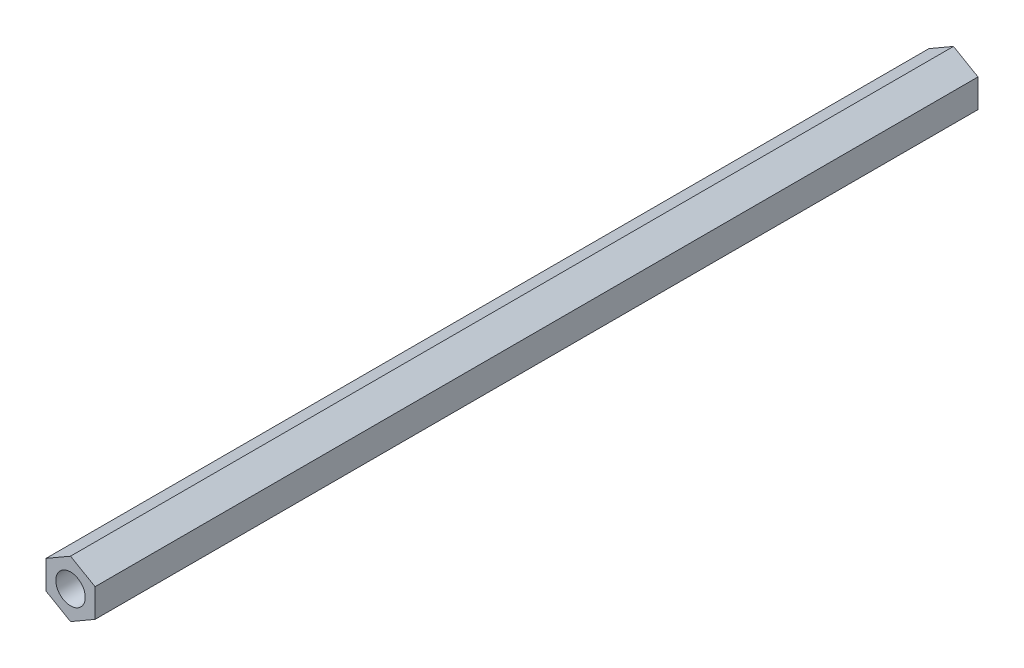
ISO-10303-21;
HEADER;
FILE_DESCRIPTION(('STEP AP214'),'2;1');
FILE_NAME('part.step','',(''),(''),'','','');
FILE_SCHEMA(('AUTOMOTIVE_DESIGN { 1 0 10303 214 1 1 1 1 }'));
ENDSEC;
DATA;
#1=APPLICATION_CONTEXT('core data for automotive mechanical design processes');
#2=APPLICATION_PROTOCOL_DEFINITION('international standard','automotive_design',2000,#1);
#3=PRODUCT_CONTEXT('',#1,'mechanical');
#4=PRODUCT('Part','Part','',(#3));
#5=PRODUCT_RELATED_PRODUCT_CATEGORY('part','',(#4));
#6=PRODUCT_DEFINITION_FORMATION('','',#4);
#7=PRODUCT_DEFINITION_CONTEXT('part definition',#1,'design');
#8=PRODUCT_DEFINITION('design','',#6,#7);
#9=PRODUCT_DEFINITION_SHAPE('','',#8);
#10=(LENGTH_UNIT() NAMED_UNIT(*) SI_UNIT(.MILLI.,.METRE.));
#11=(NAMED_UNIT(*) PLANE_ANGLE_UNIT() SI_UNIT($,.RADIAN.));
#12=(NAMED_UNIT(*) SI_UNIT($,.STERADIAN.) SOLID_ANGLE_UNIT());
#13=UNCERTAINTY_MEASURE_WITH_UNIT(LENGTH_MEASURE(1.E-05),#10,'distance_accuracy_value','');
#14=(GEOMETRIC_REPRESENTATION_CONTEXT(3) GLOBAL_UNCERTAINTY_ASSIGNED_CONTEXT((#13)) GLOBAL_UNIT_ASSIGNED_CONTEXT((#10,
#11,#12)) REPRESENTATION_CONTEXT('',''));
#15=CARTESIAN_POINT('',(0.,0.,0.));
#16=DIRECTION('',(0.,0.,1.));
#17=DIRECTION('',(1.,0.,0.));
#18=AXIS2_PLACEMENT_3D('',#15,#16,#17);
#19=CARTESIAN_POINT('',(0.,0.,90.));
#20=DIRECTION('',(0.,0.,1.));
#21=DIRECTION('',(1.,0.,0.));
#22=AXIS2_PLACEMENT_3D('',#19,#20,#21);
#23=PLANE('',#22);
#24=DIRECTION('',(-0.866025403784439,0.5,0.));
#25=VECTOR('',#24,1.);
#26=CARTESIAN_POINT('',(2.5,1.44337567297407,90.));
#27=LINE('',#26,#25);
#28=CARTESIAN_POINT('',(2.5,1.44337567297407,90.));
#29=VERTEX_POINT('',#28);
#30=CARTESIAN_POINT('',(0.,2.88675134594813,90.));
#31=VERTEX_POINT('',#30);
#32=EDGE_CURVE('E129',#29,#31,#27,.T.);
#33=ORIENTED_EDGE('',*,*,#32,.T.);
#34=DIRECTION('',(-0.866025403784439,-0.5,0.));
#35=VECTOR('',#34,1.);
#36=CARTESIAN_POINT('',(0.,2.88675134594813,90.));
#37=LINE('',#36,#35);
#38=CARTESIAN_POINT('',(-2.5,1.44337567297407,90.));
#39=VERTEX_POINT('',#38);
#40=EDGE_CURVE('E87',#31,#39,#37,.T.);
#41=ORIENTED_EDGE('',*,*,#40,.T.);
#42=DIRECTION('',(0.,-1.,0.));
#43=VECTOR('',#42,1.);
#44=CARTESIAN_POINT('',(-2.5,1.44337567297407,90.));
#45=LINE('',#44,#43);
#46=CARTESIAN_POINT('',(-2.5,-1.44337567297406,90.));
#47=VERTEX_POINT('',#46);
#48=EDGE_CURVE('E100',#39,#47,#45,.T.);
#49=ORIENTED_EDGE('',*,*,#48,.T.);
#50=DIRECTION('',(0.866025403784439,-0.5,0.));
#51=VECTOR('',#50,1.);
#52=CARTESIAN_POINT('',(-2.5,-1.44337567297406,90.));
#53=LINE('',#52,#51);
#54=CARTESIAN_POINT('',(0.,-2.88675134594813,90.));
#55=VERTEX_POINT('',#54);
#56=EDGE_CURVE('E94',#47,#55,#53,.T.);
#57=ORIENTED_EDGE('',*,*,#56,.T.);
#58=DIRECTION('',(0.866025403784439,0.5,0.));
#59=VECTOR('',#58,1.);
#60=CARTESIAN_POINT('',(0.,-2.88675134594813,90.));
#61=LINE('',#60,#59);
#62=CARTESIAN_POINT('',(2.5,-1.44337567297407,90.));
#63=VERTEX_POINT('',#62);
#64=EDGE_CURVE('E98',#55,#63,#61,.T.);
#65=ORIENTED_EDGE('',*,*,#64,.T.);
#66=DIRECTION('',(0.,1.,0.));
#67=VECTOR('',#66,1.);
#68=CARTESIAN_POINT('',(2.5,-1.44337567297407,90.));
#69=LINE('',#68,#67);
#70=EDGE_CURVE('E50',#63,#29,#69,.T.);
#71=ORIENTED_EDGE('',*,*,#70,.T.);
#72=EDGE_LOOP('',(#33,#41,#49,#57,#65,#71));
#73=FACE_BOUND('',#72,.T.);
#74=CARTESIAN_POINT('',(0.,0.,90.));
#75=DIRECTION('',(0.,0.,1.));
#76=DIRECTION('',(1.,0.,0.));
#77=AXIS2_PLACEMENT_3D('',#74,#75,#76);
#78=CIRCLE('',#77,1.5);
#79=CARTESIAN_POINT('',(1.5,0.,90.));
#80=VERTEX_POINT('',#79);
#81=EDGE_CURVE('E122',#80,#80,#78,.T.);
#82=ORIENTED_EDGE('',*,*,#81,.F.);
#83=EDGE_LOOP('',(#82));
#84=FACE_BOUND('',#83,.T.);
#85=ADVANCED_FACE('F33',(#73,#84),#23,.T.);
#86=CARTESIAN_POINT('',(0.,0.,0.));
#87=DIRECTION('',(0.,0.,1.));
#88=DIRECTION('',(1.,0.,0.));
#89=AXIS2_PLACEMENT_3D('',#86,#87,#88);
#90=PLANE('',#89);
#91=DIRECTION('',(-0.866025403784439,0.5,0.));
#92=VECTOR('',#91,1.);
#93=CARTESIAN_POINT('',(2.5,1.44337567297407,0.));
#94=LINE('',#93,#92);
#95=CARTESIAN_POINT('',(2.5,1.44337567297407,0.));
#96=VERTEX_POINT('',#95);
#97=CARTESIAN_POINT('',(0.,2.88675134594813,0.));
#98=VERTEX_POINT('',#97);
#99=EDGE_CURVE('E118',#96,#98,#94,.T.);
#100=ORIENTED_EDGE('',*,*,#99,.F.);
#101=DIRECTION('',(0.,1.,0.));
#102=VECTOR('',#101,1.);
#103=CARTESIAN_POINT('',(2.5,-1.44337567297407,0.));
#104=LINE('',#103,#102);
#105=CARTESIAN_POINT('',(2.5,-1.44337567297407,0.));
#106=VERTEX_POINT('',#105);
#107=EDGE_CURVE('E79',#106,#96,#104,.T.);
#108=ORIENTED_EDGE('',*,*,#107,.F.);
#109=DIRECTION('',(0.866025403784439,0.5,0.));
#110=VECTOR('',#109,1.);
#111=CARTESIAN_POINT('',(0.,-2.88675134594813,0.));
#112=LINE('',#111,#110);
#113=CARTESIAN_POINT('',(0.,-2.88675134594813,0.));
#114=VERTEX_POINT('',#113);
#115=EDGE_CURVE('E73',#114,#106,#112,.T.);
#116=ORIENTED_EDGE('',*,*,#115,.F.);
#117=DIRECTION('',(0.866025403784439,-0.5,0.));
#118=VECTOR('',#117,1.);
#119=CARTESIAN_POINT('',(-2.5,-1.44337567297406,0.));
#120=LINE('',#119,#118);
#121=CARTESIAN_POINT('',(-2.5,-1.44337567297406,0.));
#122=VERTEX_POINT('',#121);
#123=EDGE_CURVE('E108',#122,#114,#120,.T.);
#124=ORIENTED_EDGE('',*,*,#123,.F.);
#125=DIRECTION('',(0.,-1.,0.));
#126=VECTOR('',#125,1.);
#127=CARTESIAN_POINT('',(-2.5,1.44337567297407,0.));
#128=LINE('',#127,#126);
#129=CARTESIAN_POINT('',(-2.5,1.44337567297407,0.));
#130=VERTEX_POINT('',#129);
#131=EDGE_CURVE('E124',#130,#122,#128,.T.);
#132=ORIENTED_EDGE('',*,*,#131,.F.);
#133=DIRECTION('',(-0.866025403784439,-0.5,0.));
#134=VECTOR('',#133,1.);
#135=CARTESIAN_POINT('',(0.,2.88675134594813,0.));
#136=LINE('',#135,#134);
#137=EDGE_CURVE('E121',#98,#130,#136,.T.);
#138=ORIENTED_EDGE('',*,*,#137,.F.);
#139=EDGE_LOOP('',(#100,#108,#116,#124,#132,#138));
#140=FACE_BOUND('',#139,.T.);
#141=CARTESIAN_POINT('',(0.,0.,0.));
#142=DIRECTION('',(0.,0.,1.));
#143=DIRECTION('',(1.,0.,0.));
#144=AXIS2_PLACEMENT_3D('',#141,#142,#143);
#145=CIRCLE('',#144,1.5);
#146=CARTESIAN_POINT('',(1.5,0.,0.));
#147=VERTEX_POINT('',#146);
#148=EDGE_CURVE('E222',#147,#147,#145,.T.);
#149=ORIENTED_EDGE('',*,*,#148,.T.);
#150=EDGE_LOOP('',(#149));
#151=FACE_BOUND('',#150,.T.);
#152=ADVANCED_FACE('F138',(#140,#151),#90,.F.);
#153=CARTESIAN_POINT('',(2.5,1.44337567297407,90.));
#154=DIRECTION('',(-0.5,-0.866025403784439,0.));
#155=DIRECTION('',(0.866025403784439,-0.5,0.));
#156=AXIS2_PLACEMENT_3D('',#153,#154,#155);
#157=PLANE('',#156);
#158=ORIENTED_EDGE('',*,*,#99,.T.);
#159=DIRECTION('',(0.,0.,-1.));
#160=VECTOR('',#159,1.);
#161=CARTESIAN_POINT('',(0.,2.88675134594813,90.));
#162=LINE('',#161,#160);
#163=EDGE_CURVE('E11',#31,#98,#162,.T.);
#164=ORIENTED_EDGE('',*,*,#163,.F.);
#165=ORIENTED_EDGE('',*,*,#32,.F.);
#166=DIRECTION('',(0.,0.,-1.));
#167=VECTOR('',#166,1.);
#168=CARTESIAN_POINT('',(2.5,1.44337567297407,90.));
#169=LINE('',#168,#167);
#170=EDGE_CURVE('E114',#29,#96,#169,.T.);
#171=ORIENTED_EDGE('',*,*,#170,.T.);
#172=EDGE_LOOP('',(#158,#164,#165,#171));
#173=FACE_BOUND('',#172,.T.);
#174=ADVANCED_FACE('F35',(#173),#157,.F.);
#175=CARTESIAN_POINT('',(0.,2.88675134594813,90.));
#176=DIRECTION('',(0.5,-0.866025403784439,0.));
#177=DIRECTION('',(0.866025403784439,0.5,0.));
#178=AXIS2_PLACEMENT_3D('',#175,#176,#177);
#179=PLANE('',#178);
#180=ORIENTED_EDGE('',*,*,#137,.T.);
#181=DIRECTION('',(0.,0.,-1.));
#182=VECTOR('',#181,1.);
#183=CARTESIAN_POINT('',(-2.5,1.44337567297407,90.));
#184=LINE('',#183,#182);
#185=EDGE_CURVE('E42',#39,#130,#184,.T.);
#186=ORIENTED_EDGE('',*,*,#185,.F.);
#187=ORIENTED_EDGE('',*,*,#40,.F.);
#188=ORIENTED_EDGE('',*,*,#163,.T.);
#189=EDGE_LOOP('',(#180,#186,#187,#188));
#190=FACE_BOUND('',#189,.T.);
#191=ADVANCED_FACE('F163',(#190),#179,.F.);
#192=CARTESIAN_POINT('',(-2.5,1.44337567297407,90.));
#193=DIRECTION('',(1.,0.,0.));
#194=DIRECTION('',(0.,0.,-1.));
#195=AXIS2_PLACEMENT_3D('',#192,#193,#194);
#196=PLANE('',#195);
#197=ORIENTED_EDGE('',*,*,#131,.T.);
#198=DIRECTION('',(0.,0.,-1.));
#199=VECTOR('',#198,1.);
#200=CARTESIAN_POINT('',(-2.5,-1.44337567297406,90.));
#201=LINE('',#200,#199);
#202=EDGE_CURVE('E109',#47,#122,#201,.T.);
#203=ORIENTED_EDGE('',*,*,#202,.F.);
#204=ORIENTED_EDGE('',*,*,#48,.F.);
#205=ORIENTED_EDGE('',*,*,#185,.T.);
#206=EDGE_LOOP('',(#197,#203,#204,#205));
#207=FACE_BOUND('',#206,.T.);
#208=ADVANCED_FACE('F135',(#207),#196,.F.);
#209=CARTESIAN_POINT('',(-2.5,-1.44337567297406,90.));
#210=DIRECTION('',(0.5,0.866025403784439,0.));
#211=DIRECTION('',(-0.866025403784439,0.5,0.));
#212=AXIS2_PLACEMENT_3D('',#209,#210,#211);
#213=PLANE('',#212);
#214=ORIENTED_EDGE('',*,*,#123,.T.);
#215=DIRECTION('',(0.,0.,-1.));
#216=VECTOR('',#215,1.);
#217=CARTESIAN_POINT('',(0.,-2.88675134594813,90.));
#218=LINE('',#217,#216);
#219=EDGE_CURVE('E105',#55,#114,#218,.T.);
#220=ORIENTED_EDGE('',*,*,#219,.F.);
#221=ORIENTED_EDGE('',*,*,#56,.F.);
#222=ORIENTED_EDGE('',*,*,#202,.T.);
#223=EDGE_LOOP('',(#214,#220,#221,#222));
#224=FACE_BOUND('',#223,.T.);
#225=ADVANCED_FACE('F106',(#224),#213,.F.);
#226=CARTESIAN_POINT('',(0.,-2.88675134594813,90.));
#227=DIRECTION('',(-0.5,0.866025403784439,0.));
#228=DIRECTION('',(-0.866025403784439,-0.5,0.));
#229=AXIS2_PLACEMENT_3D('',#226,#227,#228);
#230=PLANE('',#229);
#231=ORIENTED_EDGE('',*,*,#115,.T.);
#232=DIRECTION('',(0.,0.,-1.));
#233=VECTOR('',#232,1.);
#234=CARTESIAN_POINT('',(2.5,-1.44337567297407,90.));
#235=LINE('',#234,#233);
#236=EDGE_CURVE('E110',#63,#106,#235,.T.);
#237=ORIENTED_EDGE('',*,*,#236,.F.);
#238=ORIENTED_EDGE('',*,*,#64,.F.);
#239=ORIENTED_EDGE('',*,*,#219,.T.);
#240=EDGE_LOOP('',(#231,#237,#238,#239));
#241=FACE_BOUND('',#240,.T.);
#242=ADVANCED_FACE('F112',(#241),#230,.F.);
#243=CARTESIAN_POINT('',(2.5,-1.44337567297407,90.));
#244=DIRECTION('',(-1.,0.,0.));
#245=DIRECTION('',(0.,-1.,0.));
#246=AXIS2_PLACEMENT_3D('',#243,#244,#245);
#247=PLANE('',#246);
#248=ORIENTED_EDGE('',*,*,#107,.T.);
#249=ORIENTED_EDGE('',*,*,#170,.F.);
#250=ORIENTED_EDGE('',*,*,#70,.F.);
#251=ORIENTED_EDGE('',*,*,#236,.T.);
#252=EDGE_LOOP('',(#248,#249,#250,#251));
#253=FACE_BOUND('',#252,.T.);
#254=ADVANCED_FACE('F143',(#253),#247,.F.);
#255=CARTESIAN_POINT('',(0.,0.,90.));
#256=DIRECTION('',(0.,0.,-1.));
#257=DIRECTION('',(-1.,0.,0.));
#258=AXIS2_PLACEMENT_3D('',#255,#256,#257);
#259=CYLINDRICAL_SURFACE('',#258,1.5);
#260=ORIENTED_EDGE('',*,*,#81,.T.);
#261=EDGE_LOOP('',(#260));
#262=FACE_BOUND('',#261,.T.);
#263=ORIENTED_EDGE('',*,*,#148,.F.);
#264=EDGE_LOOP('',(#263));
#265=FACE_BOUND('',#264,.T.);
#266=ADVANCED_FACE('F145',(#262,#265),#259,.F.);
#267=CLOSED_SHELL('',(#85,#152,#174,#191,#208,#225,#242,#254,#266));
#268=MANIFOLD_SOLID_BREP('B2',#267);
#269=ADVANCED_BREP_SHAPE_REPRESENTATION('',(#18,#268),#14);
#270=SHAPE_DEFINITION_REPRESENTATION(#9,#269);
ENDSEC;
END-ISO-10303-21;
